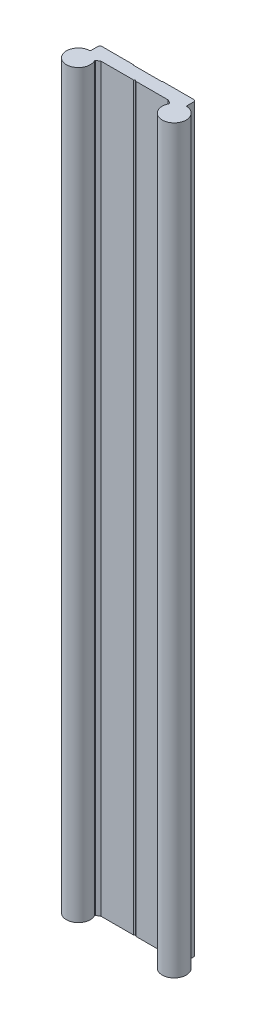
ISO-10303-21;
HEADER;
FILE_DESCRIPTION(('STEP AP214'),'2;1');
FILE_NAME('part.step','',(''),(''),'','','');
FILE_SCHEMA(('AUTOMOTIVE_DESIGN { 1 0 10303 214 1 1 1 1 }'));
ENDSEC;
DATA;
#1=APPLICATION_CONTEXT('core data for automotive mechanical design processes');
#2=APPLICATION_PROTOCOL_DEFINITION('international standard','automotive_design',2000,#1);
#3=PRODUCT_CONTEXT('',#1,'mechanical');
#4=PRODUCT('Part','Part','',(#3));
#5=PRODUCT_RELATED_PRODUCT_CATEGORY('part','',(#4));
#6=PRODUCT_DEFINITION_FORMATION('','',#4);
#7=PRODUCT_DEFINITION_CONTEXT('part definition',#1,'design');
#8=PRODUCT_DEFINITION('design','',#6,#7);
#9=PRODUCT_DEFINITION_SHAPE('','',#8);
#10=(LENGTH_UNIT() NAMED_UNIT(*) SI_UNIT(.MILLI.,.METRE.));
#11=(NAMED_UNIT(*) PLANE_ANGLE_UNIT() SI_UNIT($,.RADIAN.));
#12=(NAMED_UNIT(*) SI_UNIT($,.STERADIAN.) SOLID_ANGLE_UNIT());
#13=UNCERTAINTY_MEASURE_WITH_UNIT(LENGTH_MEASURE(1.E-05),#10,'distance_accuracy_value','');
#14=(GEOMETRIC_REPRESENTATION_CONTEXT(3) GLOBAL_UNCERTAINTY_ASSIGNED_CONTEXT((#13)) GLOBAL_UNIT_ASSIGNED_CONTEXT((#10,
#11,#12)) REPRESENTATION_CONTEXT('',''));
#15=CARTESIAN_POINT('',(0.,0.,0.));
#16=DIRECTION('',(0.,0.,1.));
#17=DIRECTION('',(1.,0.,0.));
#18=AXIS2_PLACEMENT_3D('',#15,#16,#17);
#19=CARTESIAN_POINT('',(-5.9,12.,0.1));
#20=DIRECTION('',(0.707106781186547,0.,-0.707106781186548));
#21=DIRECTION('',(-0.707106781186548,0.,-0.707106781186547));
#22=AXIS2_PLACEMENT_3D('',#19,#20,#21);
#23=PLANE('',#22);
#24=DIRECTION('',(-0.707106781186548,0.,-0.707106781186547));
#25=VECTOR('',#24,1.);
#26=CARTESIAN_POINT('',(-5.9,12.,0.1));
#27=LINE('',#26,#25);
#28=CARTESIAN_POINT('',(-5.8,12.,0.2));
#29=VERTEX_POINT('',#28);
#30=CARTESIAN_POINT('',(-6.,12.,0.));
#31=VERTEX_POINT('',#30);
#32=EDGE_CURVE('E274',#29,#31,#27,.T.);
#33=ORIENTED_EDGE('',*,*,#32,.T.);
#34=DIRECTION('',(0.,1.,0.));
#35=VECTOR('',#34,1.);
#36=CARTESIAN_POINT('',(-6.,12.,0.));
#37=LINE('',#36,#35);
#38=CARTESIAN_POINT('',(-6.,321.,0.));
#39=VERTEX_POINT('',#38);
#40=EDGE_CURVE('E282',#39,#31,#37,.F.);
#41=ORIENTED_EDGE('',*,*,#40,.F.);
#42=DIRECTION('',(-0.707106781186548,0.,-0.707106781186547));
#43=VECTOR('',#42,1.);
#44=CARTESIAN_POINT('',(-5.9,321.,0.1));
#45=LINE('',#44,#43);
#46=CARTESIAN_POINT('',(-5.8,321.,0.2));
#47=VERTEX_POINT('',#46);
#48=EDGE_CURVE('E276',#39,#47,#45,.F.);
#49=ORIENTED_EDGE('',*,*,#48,.T.);
#50=DIRECTION('',(0.,1.,0.));
#51=VECTOR('',#50,1.);
#52=CARTESIAN_POINT('',(-5.8,12.,0.2));
#53=LINE('',#52,#51);
#54=EDGE_CURVE('E222',#29,#47,#53,.T.);
#55=ORIENTED_EDGE('',*,*,#54,.F.);
#56=EDGE_LOOP('',(#33,#41,#49,#55));
#57=FACE_BOUND('',#56,.T.);
#58=ADVANCED_FACE('F17',(#57),#23,.T.);
#59=CARTESIAN_POINT('',(5.9,12.,0.1));
#60=DIRECTION('',(-0.707106781186547,0.,-0.707106781186548));
#61=DIRECTION('',(-0.707106781186548,0.,0.707106781186547));
#62=AXIS2_PLACEMENT_3D('',#59,#60,#61);
#63=PLANE('',#62);
#64=DIRECTION('',(-0.707106781186548,0.,0.707106781186547));
#65=VECTOR('',#64,1.);
#66=CARTESIAN_POINT('',(5.9,12.,0.1));
#67=LINE('',#66,#65);
#68=CARTESIAN_POINT('',(6.,12.,0.));
#69=VERTEX_POINT('',#68);
#70=CARTESIAN_POINT('',(5.8,12.,0.2));
#71=VERTEX_POINT('',#70);
#72=EDGE_CURVE('E263',#69,#71,#67,.T.);
#73=ORIENTED_EDGE('',*,*,#72,.T.);
#74=DIRECTION('',(0.,1.,0.));
#75=VECTOR('',#74,1.);
#76=CARTESIAN_POINT('',(5.8,12.,0.2));
#77=LINE('',#76,#75);
#78=CARTESIAN_POINT('',(5.8,321.,0.2));
#79=VERTEX_POINT('',#78);
#80=EDGE_CURVE('E281',#79,#71,#77,.F.);
#81=ORIENTED_EDGE('',*,*,#80,.F.);
#82=DIRECTION('',(-0.707106781186548,0.,0.707106781186547));
#83=VECTOR('',#82,1.);
#84=CARTESIAN_POINT('',(5.9,321.,0.1));
#85=LINE('',#84,#83);
#86=CARTESIAN_POINT('',(6.,321.,0.));
#87=VERTEX_POINT('',#86);
#88=EDGE_CURVE('E121',#79,#87,#85,.F.);
#89=ORIENTED_EDGE('',*,*,#88,.T.);
#90=DIRECTION('',(0.,1.,0.));
#91=VECTOR('',#90,1.);
#92=CARTESIAN_POINT('',(6.,12.,0.));
#93=LINE('',#92,#91);
#94=EDGE_CURVE('E221',#69,#87,#93,.T.);
#95=ORIENTED_EDGE('',*,*,#94,.F.);
#96=EDGE_LOOP('',(#73,#81,#89,#95));
#97=FACE_BOUND('',#96,.T.);
#98=ADVANCED_FACE('F474',(#97),#63,.T.);
#99=CARTESIAN_POINT('',(19.75,12.,0.25));
#100=DIRECTION('',(0.707106781186548,0.,-0.707106781186548));
#101=DIRECTION('',(-0.707106781186548,0.,-0.707106781186548));
#102=AXIS2_PLACEMENT_3D('',#99,#100,#101);
#103=PLANE('',#102);
#104=DIRECTION('',(-0.707106781186548,0.,-0.707106781186548));
#105=VECTOR('',#104,1.);
#106=CARTESIAN_POINT('',(19.75,12.,0.25));
#107=LINE('',#106,#105);
#108=CARTESIAN_POINT('',(20.,12.,0.5));
#109=VERTEX_POINT('',#108);
#110=CARTESIAN_POINT('',(19.5,12.,0.));
#111=VERTEX_POINT('',#110);
#112=EDGE_CURVE('E99',#109,#111,#107,.T.);
#113=ORIENTED_EDGE('',*,*,#112,.T.);
#114=DIRECTION('',(0.,1.,0.));
#115=VECTOR('',#114,1.);
#116=CARTESIAN_POINT('',(19.5,12.,0.));
#117=LINE('',#116,#115);
#118=CARTESIAN_POINT('',(19.5,321.,0.));
#119=VERTEX_POINT('',#118);
#120=EDGE_CURVE('E218',#119,#111,#117,.F.);
#121=ORIENTED_EDGE('',*,*,#120,.F.);
#122=DIRECTION('',(-0.707106781186548,0.,-0.707106781186548));
#123=VECTOR('',#122,1.);
#124=CARTESIAN_POINT('',(19.75,321.,0.25));
#125=LINE('',#124,#123);
#126=CARTESIAN_POINT('',(20.,321.,0.5));
#127=VERTEX_POINT('',#126);
#128=EDGE_CURVE('E112',#119,#127,#125,.F.);
#129=ORIENTED_EDGE('',*,*,#128,.T.);
#130=DIRECTION('',(0.,1.,0.));
#131=VECTOR('',#130,1.);
#132=CARTESIAN_POINT('',(20.,12.,0.5));
#133=LINE('',#132,#131);
#134=EDGE_CURVE('E340',#109,#127,#133,.T.);
#135=ORIENTED_EDGE('',*,*,#134,.F.);
#136=EDGE_LOOP('',(#113,#121,#129,#135));
#137=FACE_BOUND('',#136,.T.);
#138=ADVANCED_FACE('F478',(#137),#103,.T.);
#139=CARTESIAN_POINT('',(20.3,12.,3.70849738));
#140=DIRECTION('',(0.,1.,0.));
#141=DIRECTION('',(0.,0.,1.));
#142=AXIS2_PLACEMENT_3D('',#139,#140,#141);
#143=CYLINDRICAL_SURFACE('',#142,0.300000003529729);
#144=DIRECTION('',(0.,1.,0.));
#145=VECTOR('',#144,1.);
#146=CARTESIAN_POINT('',(20.28301887007,12.,4.00801639876543));
#147=LINE('',#146,#145);
#148=CARTESIAN_POINT('',(20.2830188688959,12.,4.00801639928308));
#149=VERTEX_POINT('',#148);
#150=CARTESIAN_POINT('',(20.2830188688959,321.,4.00801639928308));
#151=VERTEX_POINT('',#150);
#152=EDGE_CURVE('E331',#149,#151,#147,.T.);
#153=ORIENTED_EDGE('',*,*,#152,.F.);
#154=CARTESIAN_POINT('',(20.3,12.,3.70849738));
#155=DIRECTION('',(0.,1.,0.));
#156=DIRECTION('',(0.,0.,1.));
#157=AXIS2_PLACEMENT_3D('',#154,#155,#156);
#158=CIRCLE('',#157,0.300000003529729);
#159=CARTESIAN_POINT('',(20.,12.,3.70849738));
#160=VERTEX_POINT('',#159);
#161=EDGE_CURVE('E20',#160,#149,#158,.T.);
#162=ORIENTED_EDGE('',*,*,#161,.F.);
#163=DIRECTION('',(0.,1.,0.));
#164=VECTOR('',#163,1.);
#165=CARTESIAN_POINT('',(20.,12.,3.70849738));
#166=LINE('',#165,#164);
#167=CARTESIAN_POINT('',(20.,321.,3.70849738));
#168=VERTEX_POINT('',#167);
#169=EDGE_CURVE('E336',#168,#160,#166,.F.);
#170=ORIENTED_EDGE('',*,*,#169,.F.);
#171=CARTESIAN_POINT('',(20.3,321.,3.70849738));
#172=DIRECTION('',(0.,1.,0.));
#173=DIRECTION('',(0.,0.,1.));
#174=AXIS2_PLACEMENT_3D('',#171,#172,#173);
#175=CIRCLE('',#174,0.300000003529729);
#176=EDGE_CURVE('E259',#151,#168,#175,.F.);
#177=ORIENTED_EDGE('',*,*,#176,.F.);
#178=EDGE_LOOP('',(#153,#162,#170,#177));
#179=FACE_BOUND('',#178,.T.);
#180=ADVANCED_FACE('F335',(#179),#143,.F.);
#181=CARTESIAN_POINT('',(15.28152165,12.,6.58629703));
#182=DIRECTION('',(0.,1.,0.));
#183=DIRECTION('',(0.,0.,1.));
#184=AXIS2_PLACEMENT_3D('',#181,#182,#183);
#185=CYLINDRICAL_SURFACE('',#184,0.299999999016777);
#186=DIRECTION('',(0.,1.,0.));
#187=VECTOR('',#186,1.);
#188=CARTESIAN_POINT('',(15.43152165,12.,6.32648941));
#189=LINE('',#188,#187);
#190=CARTESIAN_POINT('',(15.4315216497557,12.,6.32648940985894));
#191=VERTEX_POINT('',#190);
#192=CARTESIAN_POINT('',(15.4315216497557,321.,6.32648940985894));
#193=VERTEX_POINT('',#192);
#194=EDGE_CURVE('E307',#191,#193,#189,.T.);
#195=ORIENTED_EDGE('',*,*,#194,.F.);
#196=CARTESIAN_POINT('',(15.28152165,12.,6.58629703));
#197=DIRECTION('',(0.,1.,0.));
#198=DIRECTION('',(0.,0.,1.));
#199=AXIS2_PLACEMENT_3D('',#196,#197,#198);
#200=CIRCLE('',#199,0.299999999016777);
#201=CARTESIAN_POINT('',(15.5486053297928,12.,6.72292172805329));
#202=VERTEX_POINT('',#201);
#203=EDGE_CURVE('E258',#202,#191,#200,.T.);
#204=ORIENTED_EDGE('',*,*,#203,.F.);
#205=DIRECTION('',(0.,1.,0.));
#206=VECTOR('',#205,1.);
#207=CARTESIAN_POINT('',(15.54860533,12.,6.72292173000001));
#208=LINE('',#207,#206);
#209=CARTESIAN_POINT('',(15.5486053297928,321.,6.72292172805329));
#210=VERTEX_POINT('',#209);
#211=EDGE_CURVE('E197',#210,#202,#208,.F.);
#212=ORIENTED_EDGE('',*,*,#211,.F.);
#213=CARTESIAN_POINT('',(15.28152165,321.,6.58629703));
#214=DIRECTION('',(0.,1.,0.));
#215=DIRECTION('',(0.,0.,1.));
#216=AXIS2_PLACEMENT_3D('',#213,#214,#215);
#217=CIRCLE('',#216,0.299999999016777);
#218=EDGE_CURVE('E188',#193,#210,#217,.F.);
#219=ORIENTED_EDGE('',*,*,#218,.F.);
#220=EDGE_LOOP('',(#195,#204,#212,#219));
#221=FACE_BOUND('',#220,.T.);
#222=ADVANCED_FACE('F328',(#221),#185,.F.);
#223=CARTESIAN_POINT('',(0.25,12.,5.355662435));
#224=DIRECTION('',(-0.499999994031163,0.,0.866025407230548));
#225=DIRECTION('',(0.866025407230548,0.,0.499999994031163));
#226=AXIS2_PLACEMENT_3D('',#223,#224,#225);
#227=PLANE('',#226);
#228=DIRECTION('',(0.866025407230548,0.,0.499999994031163));
#229=VECTOR('',#228,1.);
#230=CARTESIAN_POINT('',(0.25,12.,5.355662435));
#231=LINE('',#230,#229);
#232=CARTESIAN_POINT('',(0.,12.,5.21132487));
#233=VERTEX_POINT('',#232);
#234=CARTESIAN_POINT('',(0.5,12.,5.5));
#235=VERTEX_POINT('',#234);
#236=EDGE_CURVE('E187',#233,#235,#231,.T.);
#237=ORIENTED_EDGE('',*,*,#236,.T.);
#238=DIRECTION('',(0.,1.,0.));
#239=VECTOR('',#238,1.);
#240=CARTESIAN_POINT('',(0.5,12.,5.5));
#241=LINE('',#240,#239);
#242=CARTESIAN_POINT('',(0.5,321.,5.5));
#243=VERTEX_POINT('',#242);
#244=EDGE_CURVE('E191',#243,#235,#241,.F.);
#245=ORIENTED_EDGE('',*,*,#244,.F.);
#246=DIRECTION('',(0.866025407230548,0.,0.499999994031163));
#247=VECTOR('',#246,1.);
#248=CARTESIAN_POINT('',(0.25,321.,5.355662435));
#249=LINE('',#248,#247);
#250=CARTESIAN_POINT('',(0.,321.,5.21132487));
#251=VERTEX_POINT('',#250);
#252=EDGE_CURVE('E176',#243,#251,#249,.F.);
#253=ORIENTED_EDGE('',*,*,#252,.T.);
#254=DIRECTION('',(0.,1.,0.));
#255=VECTOR('',#254,1.);
#256=CARTESIAN_POINT('',(0.,12.,5.21132487));
#257=LINE('',#256,#255);
#258=EDGE_CURVE('E295',#233,#251,#257,.T.);
#259=ORIENTED_EDGE('',*,*,#258,.F.);
#260=EDGE_LOOP('',(#237,#245,#253,#259));
#261=FACE_BOUND('',#260,.T.);
#262=ADVANCED_FACE('F192',(#261),#227,.T.);
#263=CARTESIAN_POINT('',(14.715760825,12.,5.913244705));
#264=DIRECTION('',(-0.500000000009856,0.,0.866025403778748));
#265=DIRECTION('',(0.866025403778748,0.,0.500000000009856));
#266=AXIS2_PLACEMENT_3D('',#263,#264,#265);
#267=PLANE('',#266);
#268=DIRECTION('',(0.866025403778748,0.,0.500000000009856));
#269=VECTOR('',#268,1.);
#270=CARTESIAN_POINT('',(14.715760825,12.,5.913244705));
#271=LINE('',#270,#269);
#272=CARTESIAN_POINT('',(14.,12.,5.5));
#273=VERTEX_POINT('',#272);
#274=EDGE_CURVE('E310',#273,#191,#271,.T.);
#275=ORIENTED_EDGE('',*,*,#274,.T.);
#276=ORIENTED_EDGE('',*,*,#194,.T.);
#277=DIRECTION('',(0.866025403778748,0.,0.500000000009856));
#278=VECTOR('',#277,1.);
#279=CARTESIAN_POINT('',(14.715760825,321.,5.913244705));
#280=LINE('',#279,#278);
#281=CARTESIAN_POINT('',(14.,321.,5.5));
#282=VERTEX_POINT('',#281);
#283=EDGE_CURVE('E302',#193,#282,#280,.F.);
#284=ORIENTED_EDGE('',*,*,#283,.T.);
#285=DIRECTION('',(0.,1.,0.));
#286=VECTOR('',#285,1.);
#287=CARTESIAN_POINT('',(14.,12.,5.5));
#288=LINE('',#287,#286);
#289=EDGE_CURVE('E196',#273,#282,#288,.T.);
#290=ORIENTED_EDGE('',*,*,#289,.F.);
#291=EDGE_LOOP('',(#275,#276,#284,#290));
#292=FACE_BOUND('',#291,.T.);
#293=ADVANCED_FACE('F323',(#292),#267,.T.);
#294=CARTESIAN_POINT('',(-0.25,12.,5.355662435));
#295=DIRECTION('',(0.499999994031163,0.,0.866025407230548));
#296=DIRECTION('',(0.866025407230548,0.,-0.499999994031163));
#297=AXIS2_PLACEMENT_3D('',#294,#295,#296);
#298=PLANE('',#297);
#299=DIRECTION('',(0.866025407230548,0.,-0.499999994031163));
#300=VECTOR('',#299,1.);
#301=CARTESIAN_POINT('',(-0.25,12.,5.355662435));
#302=LINE('',#301,#300);
#303=CARTESIAN_POINT('',(-0.5,12.,5.5));
#304=VERTEX_POINT('',#303);
#305=EDGE_CURVE('E298',#304,#233,#302,.T.);
#306=ORIENTED_EDGE('',*,*,#305,.T.);
#307=ORIENTED_EDGE('',*,*,#258,.T.);
#308=DIRECTION('',(0.866025407230548,0.,-0.499999994031163));
#309=VECTOR('',#308,1.);
#310=CARTESIAN_POINT('',(-0.25,321.,5.355662435));
#311=LINE('',#310,#309);
#312=CARTESIAN_POINT('',(-0.5,321.,5.5));
#313=VERTEX_POINT('',#312);
#314=EDGE_CURVE('E183',#251,#313,#311,.F.);
#315=ORIENTED_EDGE('',*,*,#314,.T.);
#316=DIRECTION('',(0.,1.,0.));
#317=VECTOR('',#316,1.);
#318=CARTESIAN_POINT('',(-0.5,12.,5.5));
#319=LINE('',#318,#317);
#320=EDGE_CURVE('E376',#304,#313,#319,.T.);
#321=ORIENTED_EDGE('',*,*,#320,.F.);
#322=EDGE_LOOP('',(#306,#307,#315,#321));
#323=FACE_BOUND('',#322,.T.);
#324=ADVANCED_FACE('F422',(#323),#298,.T.);
#325=CARTESIAN_POINT('',(-19.75,12.,0.25));
#326=DIRECTION('',(-0.707106781186548,0.,-0.707106781186548));
#327=DIRECTION('',(-0.707106781186548,0.,0.707106781186548));
#328=AXIS2_PLACEMENT_3D('',#325,#326,#327);
#329=PLANE('',#328);
#330=DIRECTION('',(-0.707106781186548,0.,0.707106781186548));
#331=VECTOR('',#330,1.);
#332=CARTESIAN_POINT('',(-19.75,12.,0.25));
#333=LINE('',#332,#331);
#334=CARTESIAN_POINT('',(-19.5,12.,0.));
#335=VERTEX_POINT('',#334);
#336=CARTESIAN_POINT('',(-20.,12.,0.499999999999999));
#337=VERTEX_POINT('',#336);
#338=EDGE_CURVE('E256',#335,#337,#333,.T.);
#339=ORIENTED_EDGE('',*,*,#338,.T.);
#340=DIRECTION('',(0.,1.,0.));
#341=VECTOR('',#340,1.);
#342=CARTESIAN_POINT('',(-20.,12.,0.5));
#343=LINE('',#342,#341);
#344=CARTESIAN_POINT('',(-20.,321.,0.499999999999999));
#345=VERTEX_POINT('',#344);
#346=EDGE_CURVE('E373',#345,#337,#343,.F.);
#347=ORIENTED_EDGE('',*,*,#346,.F.);
#348=DIRECTION('',(-0.707106781186548,0.,0.707106781186548));
#349=VECTOR('',#348,1.);
#350=CARTESIAN_POINT('',(-19.75,321.,0.25));
#351=LINE('',#350,#349);
#352=CARTESIAN_POINT('',(-19.5,321.,0.));
#353=VERTEX_POINT('',#352);
#354=EDGE_CURVE('E297',#345,#353,#351,.F.);
#355=ORIENTED_EDGE('',*,*,#354,.T.);
#356=DIRECTION('',(0.,1.,0.));
#357=VECTOR('',#356,1.);
#358=CARTESIAN_POINT('',(-19.5,12.,0.));
#359=LINE('',#358,#357);
#360=EDGE_CURVE('E278',#335,#353,#359,.T.);
#361=ORIENTED_EDGE('',*,*,#360,.F.);
#362=EDGE_LOOP('',(#339,#347,#355,#361));
#363=FACE_BOUND('',#362,.T.);
#364=ADVANCED_FACE('F462',(#363),#329,.T.);
#365=CARTESIAN_POINT('',(-20.3,12.,3.70849738));
#366=DIRECTION('',(0.,1.,0.));
#367=DIRECTION('',(0.,0.,1.));
#368=AXIS2_PLACEMENT_3D('',#365,#366,#367);
#369=CYLINDRICAL_SURFACE('',#368,0.300000000000001);
#370=DIRECTION('',(0.,1.,0.));
#371=VECTOR('',#370,1.);
#372=CARTESIAN_POINT('',(-20.,12.,3.70849738));
#373=LINE('',#372,#371);
#374=CARTESIAN_POINT('',(-20.,12.,3.70849738));
#375=VERTEX_POINT('',#374);
#376=CARTESIAN_POINT('',(-20.,321.,3.70849738));
#377=VERTEX_POINT('',#376);
#378=EDGE_CURVE('E370',#375,#377,#373,.T.);
#379=ORIENTED_EDGE('',*,*,#378,.F.);
#380=CARTESIAN_POINT('',(-20.3,12.,3.70849738));
#381=DIRECTION('',(0.,1.,0.));
#382=DIRECTION('',(0.,0.,1.));
#383=AXIS2_PLACEMENT_3D('',#380,#381,#382);
#384=CIRCLE('',#383,0.300000000000001);
#385=CARTESIAN_POINT('',(-20.2830188689692,12.,4.00801639827392));
#386=VERTEX_POINT('',#385);
#387=EDGE_CURVE('E254',#386,#375,#384,.T.);
#388=ORIENTED_EDGE('',*,*,#387,.F.);
#389=DIRECTION('',(0.,1.,0.));
#390=VECTOR('',#389,1.);
#391=CARTESIAN_POINT('',(-20.28301887,12.,4.0080164));
#392=LINE('',#391,#390);
#393=CARTESIAN_POINT('',(-20.2830188689692,321.,4.00801639827392));
#394=VERTEX_POINT('',#393);
#395=EDGE_CURVE('E367',#394,#386,#392,.F.);
#396=ORIENTED_EDGE('',*,*,#395,.F.);
#397=CARTESIAN_POINT('',(-20.3,321.,3.70849738));
#398=DIRECTION('',(0.,1.,0.));
#399=DIRECTION('',(0.,0.,1.));
#400=AXIS2_PLACEMENT_3D('',#397,#398,#399);
#401=CIRCLE('',#400,0.300000000000001);
#402=EDGE_CURVE('E250',#377,#394,#401,.F.);
#403=ORIENTED_EDGE('',*,*,#402,.F.);
#404=EDGE_LOOP('',(#379,#388,#396,#403));
#405=FACE_BOUND('',#404,.T.);
#406=ADVANCED_FACE('F456',(#405),#369,.F.);
#407=CARTESIAN_POINT('',(-14.715760825,12.,5.913244705));
#408=DIRECTION('',(0.500000000009856,0.,0.866025403778748));
#409=DIRECTION('',(0.866025403778748,0.,-0.500000000009856));
#410=AXIS2_PLACEMENT_3D('',#407,#408,#409);
#411=PLANE('',#410);
#412=DIRECTION('',(-0.866025404465572,0.,0.499999998820242));
#413=VECTOR('',#412,1.);
#414=CARTESIAN_POINT('',(-14.,12.,5.5));
#415=LINE('',#414,#413);
#416=CARTESIAN_POINT('',(-14.,12.,5.5));
#417=VERTEX_POINT('',#416);
#418=CARTESIAN_POINT('',(-15.4315216507125,12.,6.3264894077895));
#419=VERTEX_POINT('',#418);
#420=EDGE_CURVE('E355',#417,#419,#415,.T.);
#421=ORIENTED_EDGE('',*,*,#420,.F.);
#422=DIRECTION('',(0.,1.,0.));
#423=VECTOR('',#422,1.);
#424=CARTESIAN_POINT('',(-14.,12.,5.5));
#425=LINE('',#424,#423);
#426=CARTESIAN_POINT('',(-14.,321.,5.5));
#427=VERTEX_POINT('',#426);
#428=EDGE_CURVE('E316',#427,#417,#425,.F.);
#429=ORIENTED_EDGE('',*,*,#428,.F.);
#430=DIRECTION('',(0.866025403778748,0.,-0.500000000009856));
#431=VECTOR('',#430,1.);
#432=CARTESIAN_POINT('',(-14.715760825,321.,5.913244705));
#433=LINE('',#432,#431);
#434=CARTESIAN_POINT('',(-15.4315216503233,321.,6.32648940887573));
#435=VERTEX_POINT('',#434);
#436=EDGE_CURVE('E253',#427,#435,#433,.F.);
#437=ORIENTED_EDGE('',*,*,#436,.T.);
#438=DIRECTION('',(0.,1.,0.));
#439=VECTOR('',#438,1.);
#440=CARTESIAN_POINT('',(-15.4315216511353,12.,6.32648940803359));
#441=LINE('',#440,#439);
#442=EDGE_CURVE('E245',#435,#419,#441,.F.);
#443=ORIENTED_EDGE('',*,*,#442,.T.);
#444=EDGE_LOOP('',(#421,#429,#437,#443));
#445=FACE_BOUND('',#444,.T.);
#446=ADVANCED_FACE('F429',(#445),#411,.T.);
#447=CARTESIAN_POINT('',(-12.75,12.,0.));
#448=DIRECTION('',(0.,0.,-1.));
#449=DIRECTION('',(-1.,0.,0.));
#450=AXIS2_PLACEMENT_3D('',#447,#448,#449);
#451=PLANE('',#450);
#452=DIRECTION('',(1.,0.,0.));
#453=VECTOR('',#452,1.);
#454=CARTESIAN_POINT('',(-7.8053917496046E-09,12.,0.));
#455=LINE('',#454,#453);
#456=EDGE_CURVE('E285',#335,#31,#455,.T.);
#457=ORIENTED_EDGE('',*,*,#456,.F.);
#458=ORIENTED_EDGE('',*,*,#360,.T.);
#459=DIRECTION('',(1.,0.,0.));
#460=VECTOR('',#459,1.);
#461=CARTESIAN_POINT('',(-7.80539127775981E-09,321.,0.));
#462=LINE('',#461,#460);
#463=EDGE_CURVE('E244',#353,#39,#462,.T.);
#464=ORIENTED_EDGE('',*,*,#463,.T.);
#465=ORIENTED_EDGE('',*,*,#40,.T.);
#466=EDGE_LOOP('',(#457,#458,#464,#465));
#467=FACE_BOUND('',#466,.T.);
#468=ADVANCED_FACE('F466',(#467),#451,.T.);
#469=CARTESIAN_POINT('',(2.9,12.,0.2));
#470=DIRECTION('',(0.,0.,-1.));
#471=DIRECTION('',(-1.,0.,0.));
#472=AXIS2_PLACEMENT_3D('',#469,#470,#471);
#473=PLANE('',#472);
#474=DIRECTION('',(1.,0.,0.));
#475=VECTOR('',#474,1.);
#476=CARTESIAN_POINT('',(-7.8053917496046E-09,12.,0.2));
#477=LINE('',#476,#475);
#478=EDGE_CURVE('E228',#29,#71,#477,.T.);
#479=ORIENTED_EDGE('',*,*,#478,.F.);
#480=ORIENTED_EDGE('',*,*,#54,.T.);
#481=DIRECTION('',(1.,0.,0.));
#482=VECTOR('',#481,1.);
#483=CARTESIAN_POINT('',(-7.80539127775981E-09,321.,0.2));
#484=LINE('',#483,#482);
#485=EDGE_CURVE('E234',#47,#79,#484,.T.);
#486=ORIENTED_EDGE('',*,*,#485,.T.);
#487=ORIENTED_EDGE('',*,*,#80,.T.);
#488=EDGE_LOOP('',(#479,#480,#486,#487));
#489=FACE_BOUND('',#488,.T.);
#490=ADVANCED_FACE('F473',(#489),#473,.T.);
#491=CARTESIAN_POINT('',(12.75,12.,0.));
#492=DIRECTION('',(0.,0.,-1.));
#493=DIRECTION('',(-1.,0.,0.));
#494=AXIS2_PLACEMENT_3D('',#491,#492,#493);
#495=PLANE('',#494);
#496=DIRECTION('',(1.,0.,0.));
#497=VECTOR('',#496,1.);
#498=CARTESIAN_POINT('',(-7.8053917496046E-09,12.,0.));
#499=LINE('',#498,#497);
#500=EDGE_CURVE('E225',#69,#111,#499,.T.);
#501=ORIENTED_EDGE('',*,*,#500,.F.);
#502=ORIENTED_EDGE('',*,*,#94,.T.);
#503=DIRECTION('',(1.,0.,0.));
#504=VECTOR('',#503,1.);
#505=CARTESIAN_POINT('',(-7.80539127775981E-09,321.,0.));
#506=LINE('',#505,#504);
#507=EDGE_CURVE('E231',#87,#119,#506,.T.);
#508=ORIENTED_EDGE('',*,*,#507,.T.);
#509=ORIENTED_EDGE('',*,*,#120,.T.);
#510=EDGE_LOOP('',(#501,#502,#508,#509));
#511=FACE_BOUND('',#510,.T.);
#512=ADVANCED_FACE('F477',(#511),#495,.T.);
#513=CARTESIAN_POINT('',(20.,12.,2.10424869));
#514=DIRECTION('',(1.,0.,0.));
#515=DIRECTION('',(0.,0.,-1.));
#516=AXIS2_PLACEMENT_3D('',#513,#514,#515);
#517=PLANE('',#516);
#518=DIRECTION('',(0.,0.,-1.));
#519=VECTOR('',#518,1.);
#520=CARTESIAN_POINT('',(20.,12.,5.21921116449892));
#521=LINE('',#520,#519);
#522=EDGE_CURVE('E227',#109,#160,#521,.F.);
#523=ORIENTED_EDGE('',*,*,#522,.F.);
#524=ORIENTED_EDGE('',*,*,#134,.T.);
#525=DIRECTION('',(0.,0.,-1.));
#526=VECTOR('',#525,1.);
#527=CARTESIAN_POINT('',(20.,321.,5.21921116449892));
#528=LINE('',#527,#526);
#529=EDGE_CURVE('E208',#127,#168,#528,.F.);
#530=ORIENTED_EDGE('',*,*,#529,.T.);
#531=ORIENTED_EDGE('',*,*,#169,.T.);
#532=EDGE_LOOP('',(#523,#524,#530,#531));
#533=FACE_BOUND('',#532,.T.);
#534=ADVANCED_FACE('F343',(#533),#517,.T.);
#535=CARTESIAN_POINT('',(20.,12.,9.));
#536=DIRECTION('',(0.,1.,0.));
#537=DIRECTION('',(0.,0.,1.));
#538=AXIS2_PLACEMENT_3D('',#535,#536,#537);
#539=CYLINDRICAL_SURFACE('',#538,4.99999999558106);
#540=ORIENTED_EDGE('',*,*,#211,.T.);
#541=CARTESIAN_POINT('',(20.,12.,9.));
#542=DIRECTION('',(0.,1.,0.));
#543=DIRECTION('',(0.,0.,1.));
#544=AXIS2_PLACEMENT_3D('',#541,#542,#543);
#545=CIRCLE('',#544,4.99999999558106);
#546=EDGE_CURVE('E246',#149,#202,#545,.F.);
#547=ORIENTED_EDGE('',*,*,#546,.F.);
#548=ORIENTED_EDGE('',*,*,#152,.T.);
#549=CARTESIAN_POINT('',(20.,321.,9.));
#550=DIRECTION('',(0.,1.,0.));
#551=DIRECTION('',(0.,0.,1.));
#552=AXIS2_PLACEMENT_3D('',#549,#550,#551);
#553=CIRCLE('',#552,4.99999999558106);
#554=EDGE_CURVE('E203',#151,#210,#553,.F.);
#555=ORIENTED_EDGE('',*,*,#554,.T.);
#556=EDGE_LOOP('',(#540,#547,#548,#555));
#557=FACE_BOUND('',#556,.T.);
#558=ADVANCED_FACE('F334',(#557),#539,.T.);
#559=CARTESIAN_POINT('',(7.25,12.,5.5));
#560=DIRECTION('',(0.,0.,1.));
#561=DIRECTION('',(1.,0.,0.));
#562=AXIS2_PLACEMENT_3D('',#559,#560,#561);
#563=PLANE('',#562);
#564=DIRECTION('',(1.,0.,0.));
#565=VECTOR('',#564,1.);
#566=CARTESIAN_POINT('',(-7.8053917496046E-09,12.,5.5));
#567=LINE('',#566,#565);
#568=EDGE_CURVE('E249',#273,#235,#567,.F.);
#569=ORIENTED_EDGE('',*,*,#568,.F.);
#570=ORIENTED_EDGE('',*,*,#289,.T.);
#571=DIRECTION('',(1.,0.,0.));
#572=VECTOR('',#571,1.);
#573=CARTESIAN_POINT('',(-7.80539127775981E-09,321.,5.5));
#574=LINE('',#573,#572);
#575=EDGE_CURVE('E181',#282,#243,#574,.F.);
#576=ORIENTED_EDGE('',*,*,#575,.T.);
#577=ORIENTED_EDGE('',*,*,#244,.T.);
#578=EDGE_LOOP('',(#569,#570,#576,#577));
#579=FACE_BOUND('',#578,.T.);
#580=ADVANCED_FACE('F200',(#579),#563,.T.);
#581=CARTESIAN_POINT('',(-7.25,12.,5.5));
#582=DIRECTION('',(0.,0.,1.));
#583=DIRECTION('',(1.,0.,0.));
#584=AXIS2_PLACEMENT_3D('',#581,#582,#583);
#585=PLANE('',#584);
#586=DIRECTION('',(1.,0.,0.));
#587=VECTOR('',#586,1.);
#588=CARTESIAN_POINT('',(-7.8053917496046E-09,12.,5.5));
#589=LINE('',#588,#587);
#590=EDGE_CURVE('E320',#304,#417,#589,.F.);
#591=ORIENTED_EDGE('',*,*,#590,.F.);
#592=ORIENTED_EDGE('',*,*,#320,.T.);
#593=DIRECTION('',(1.,0.,0.));
#594=VECTOR('',#593,1.);
#595=CARTESIAN_POINT('',(-7.80539127775981E-09,321.,5.5));
#596=LINE('',#595,#594);
#597=EDGE_CURVE('E202',#313,#427,#596,.F.);
#598=ORIENTED_EDGE('',*,*,#597,.T.);
#599=ORIENTED_EDGE('',*,*,#428,.T.);
#600=EDGE_LOOP('',(#591,#592,#598,#599));
#601=FACE_BOUND('',#600,.T.);
#602=ADVANCED_FACE('F425',(#601),#585,.T.);
#603=CARTESIAN_POINT('',(-20.,12.,2.10424869));
#604=DIRECTION('',(-1.,0.,0.));
#605=DIRECTION('',(0.,0.,1.));
#606=AXIS2_PLACEMENT_3D('',#603,#604,#605);
#607=PLANE('',#606);
#608=DIRECTION('',(0.,0.,-1.));
#609=VECTOR('',#608,1.);
#610=CARTESIAN_POINT('',(-20.,12.,5.21921116449892));
#611=LINE('',#610,#609);
#612=EDGE_CURVE('E288',#375,#337,#611,.T.);
#613=ORIENTED_EDGE('',*,*,#612,.F.);
#614=ORIENTED_EDGE('',*,*,#378,.T.);
#615=DIRECTION('',(0.,0.,-1.));
#616=VECTOR('',#615,1.);
#617=CARTESIAN_POINT('',(-20.,321.,5.21921116449892));
#618=LINE('',#617,#616);
#619=EDGE_CURVE('E240',#377,#345,#618,.T.);
#620=ORIENTED_EDGE('',*,*,#619,.T.);
#621=ORIENTED_EDGE('',*,*,#346,.T.);
#622=EDGE_LOOP('',(#613,#614,#620,#621));
#623=FACE_BOUND('',#622,.T.);
#624=ADVANCED_FACE('F435',(#623),#607,.T.);
#625=CARTESIAN_POINT('',(-7.8053917496046E-09,12.,5.21921116449892));
#626=DIRECTION('',(0.,-1.,0.));
#627=DIRECTION('',(0.,0.,-1.));
#628=AXIS2_PLACEMENT_3D('',#625,#626,#627);
#629=PLANE('',#628);
#630=CARTESIAN_POINT('',(-20.,12.,9.00000001));
#631=DIRECTION('',(0.,1.,0.));
#632=DIRECTION('',(0.,0.,1.));
#633=AXIS2_PLACEMENT_3D('',#630,#631,#632);
#634=CIRCLE('',#633,5.00000000432847);
#635=CARTESIAN_POINT('',(-15.5486053286593,12.,6.7229217277565));
#636=VERTEX_POINT('',#635);
#637=EDGE_CURVE('E237',#386,#636,#634,.T.);
#638=ORIENTED_EDGE('',*,*,#637,.F.);
#639=ORIENTED_EDGE('',*,*,#387,.T.);
#640=ORIENTED_EDGE('',*,*,#612,.T.);
#641=ORIENTED_EDGE('',*,*,#338,.F.);
#642=ORIENTED_EDGE('',*,*,#456,.T.);
#643=ORIENTED_EDGE('',*,*,#32,.F.);
#644=ORIENTED_EDGE('',*,*,#478,.T.);
#645=ORIENTED_EDGE('',*,*,#72,.F.);
#646=ORIENTED_EDGE('',*,*,#500,.T.);
#647=ORIENTED_EDGE('',*,*,#112,.F.);
#648=ORIENTED_EDGE('',*,*,#522,.T.);
#649=ORIENTED_EDGE('',*,*,#161,.T.);
#650=ORIENTED_EDGE('',*,*,#546,.T.);
#651=ORIENTED_EDGE('',*,*,#203,.T.);
#652=ORIENTED_EDGE('',*,*,#274,.F.);
#653=ORIENTED_EDGE('',*,*,#568,.T.);
#654=ORIENTED_EDGE('',*,*,#236,.F.);
#655=ORIENTED_EDGE('',*,*,#305,.F.);
#656=ORIENTED_EDGE('',*,*,#590,.T.);
#657=ORIENTED_EDGE('',*,*,#420,.T.);
#658=CARTESIAN_POINT('',(-15.28152165,12.,6.58629703));
#659=DIRECTION('',(0.,1.,0.));
#660=DIRECTION('',(0.,0.,1.));
#661=AXIS2_PLACEMENT_3D('',#658,#659,#660);
#662=CIRCLE('',#661,0.300000001287386);
#663=EDGE_CURVE('E242',#419,#636,#662,.T.);
#664=ORIENTED_EDGE('',*,*,#663,.T.);
#665=EDGE_LOOP('',(#638,#639,#640,#641,#642,#643,#644,#645,#646,#647,#648,#649,#650,#651,#652,
#653,#654,#655,#656,#657,#664));
#666=FACE_BOUND('',#665,.T.);
#667=ADVANCED_FACE('F431',(#666),#629,.T.);
#668=CARTESIAN_POINT('',(-15.28152165,12.,6.58629703));
#669=DIRECTION('',(0.,1.,0.));
#670=DIRECTION('',(0.,0.,1.));
#671=AXIS2_PLACEMENT_3D('',#668,#669,#670);
#672=CYLINDRICAL_SURFACE('',#671,0.300000001287386);
#673=DIRECTION('',(0.,1.,0.));
#674=VECTOR('',#673,1.);
#675=CARTESIAN_POINT('',(-15.5486053262668,12.,6.72292172809034));
#676=LINE('',#675,#674);
#677=CARTESIAN_POINT('',(-15.5486053286593,321.,6.7229217277565));
#678=VERTEX_POINT('',#677);
#679=EDGE_CURVE('E26',#636,#678,#676,.T.);
#680=ORIENTED_EDGE('',*,*,#679,.F.);
#681=ORIENTED_EDGE('',*,*,#663,.F.);
#682=ORIENTED_EDGE('',*,*,#442,.F.);
#683=CARTESIAN_POINT('',(-15.28152165,321.,6.58629703));
#684=DIRECTION('',(0.,1.,0.));
#685=DIRECTION('',(0.,0.,1.));
#686=AXIS2_PLACEMENT_3D('',#683,#684,#685);
#687=CIRCLE('',#686,0.300000001287386);
#688=EDGE_CURVE('E35',#435,#678,#687,.T.);
#689=ORIENTED_EDGE('',*,*,#688,.T.);
#690=EDGE_LOOP('',(#680,#681,#682,#689));
#691=FACE_BOUND('',#690,.T.);
#692=ADVANCED_FACE('F434',(#691),#672,.F.);
#693=CARTESIAN_POINT('',(-7.80539127775981E-09,321.,5.21921116449892));
#694=DIRECTION('',(0.,-1.,0.));
#695=DIRECTION('',(0.,0.,-1.));
#696=AXIS2_PLACEMENT_3D('',#693,#694,#695);
#697=PLANE('',#696);
#698=ORIENTED_EDGE('',*,*,#619,.F.);
#699=ORIENTED_EDGE('',*,*,#402,.T.);
#700=CARTESIAN_POINT('',(-20.,321.,9.00000001));
#701=DIRECTION('',(0.,1.,0.));
#702=DIRECTION('',(0.,0.,1.));
#703=AXIS2_PLACEMENT_3D('',#700,#701,#702);
#704=CIRCLE('',#703,5.00000000432847);
#705=EDGE_CURVE('E11',#678,#394,#704,.F.);
#706=ORIENTED_EDGE('',*,*,#705,.F.);
#707=ORIENTED_EDGE('',*,*,#688,.F.);
#708=ORIENTED_EDGE('',*,*,#436,.F.);
#709=ORIENTED_EDGE('',*,*,#597,.F.);
#710=ORIENTED_EDGE('',*,*,#314,.F.);
#711=ORIENTED_EDGE('',*,*,#252,.F.);
#712=ORIENTED_EDGE('',*,*,#575,.F.);
#713=ORIENTED_EDGE('',*,*,#283,.F.);
#714=ORIENTED_EDGE('',*,*,#218,.T.);
#715=ORIENTED_EDGE('',*,*,#554,.F.);
#716=ORIENTED_EDGE('',*,*,#176,.T.);
#717=ORIENTED_EDGE('',*,*,#529,.F.);
#718=ORIENTED_EDGE('',*,*,#128,.F.);
#719=ORIENTED_EDGE('',*,*,#507,.F.);
#720=ORIENTED_EDGE('',*,*,#88,.F.);
#721=ORIENTED_EDGE('',*,*,#485,.F.);
#722=ORIENTED_EDGE('',*,*,#48,.F.);
#723=ORIENTED_EDGE('',*,*,#463,.F.);
#724=ORIENTED_EDGE('',*,*,#354,.F.);
#725=EDGE_LOOP('',(#698,#699,#706,#707,#708,#709,#710,#711,#712,#713,#714,#715,#716,#717,#718,
#719,#720,#721,#722,#723,#724));
#726=FACE_BOUND('',#725,.T.);
#727=ADVANCED_FACE('F179',(#726),#697,.F.);
#728=CARTESIAN_POINT('',(-20.,12.,9.00000001));
#729=DIRECTION('',(0.,1.,0.));
#730=DIRECTION('',(0.,0.,1.));
#731=AXIS2_PLACEMENT_3D('',#728,#729,#730);
#732=CYLINDRICAL_SURFACE('',#731,5.00000000432847);
#733=ORIENTED_EDGE('',*,*,#679,.T.);
#734=ORIENTED_EDGE('',*,*,#705,.T.);
#735=ORIENTED_EDGE('',*,*,#395,.T.);
#736=ORIENTED_EDGE('',*,*,#637,.T.);
#737=EDGE_LOOP('',(#733,#734,#735,#736));
#738=FACE_BOUND('',#737,.T.);
#739=ADVANCED_FACE('F445',(#738),#732,.T.);
#740=CLOSED_SHELL('',(#58,#98,#138,#180,#222,#262,#293,#324,#364,#406,#446,#468,#490,#512,#534,
#558,#580,#602,#624,#667,#692,#727,#739));
#741=MANIFOLD_SOLID_BREP('B1',#740);
#742=ADVANCED_BREP_SHAPE_REPRESENTATION('',(#18,#741),#14);
#743=SHAPE_DEFINITION_REPRESENTATION(#9,#742);
ENDSEC;
END-ISO-10303-21;
